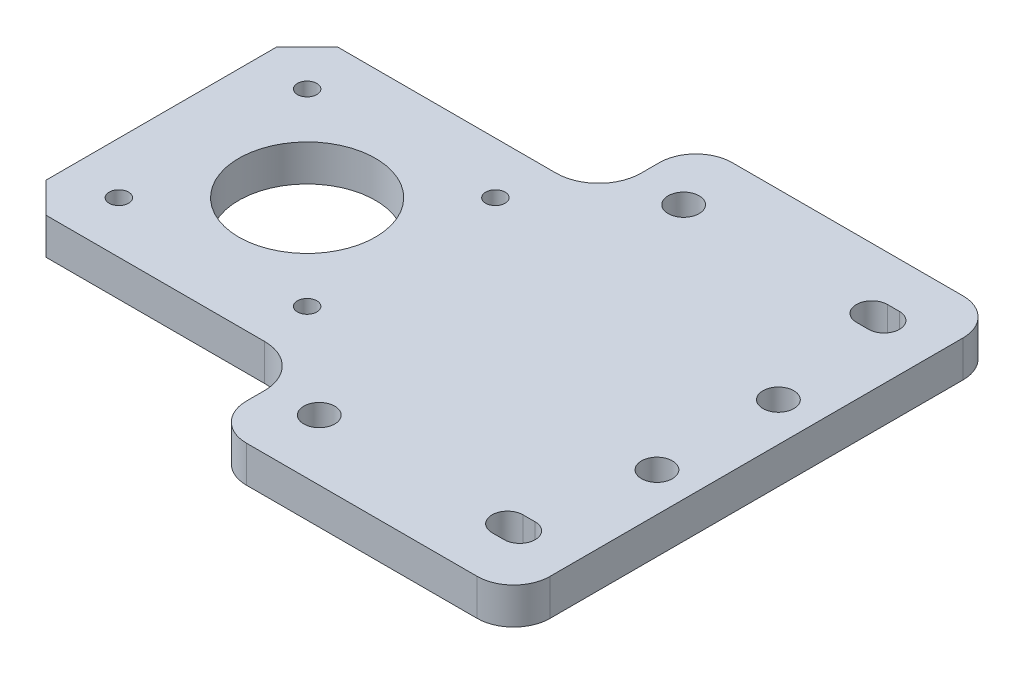
ISO-10303-21;
HEADER;
FILE_DESCRIPTION(('STEP AP214'),'2;1');
FILE_NAME('part.step','',(''),(''),'','','');
FILE_SCHEMA(('AUTOMOTIVE_DESIGN { 1 0 10303 214 1 1 1 1 }'));
ENDSEC;
DATA;
#1=APPLICATION_CONTEXT('core data for automotive mechanical design processes');
#2=APPLICATION_PROTOCOL_DEFINITION('international standard','automotive_design',2000,#1);
#3=PRODUCT_CONTEXT('',#1,'mechanical');
#4=PRODUCT('Part','Part','',(#3));
#5=PRODUCT_RELATED_PRODUCT_CATEGORY('part','',(#4));
#6=PRODUCT_DEFINITION_FORMATION('','',#4);
#7=PRODUCT_DEFINITION_CONTEXT('part definition',#1,'design');
#8=PRODUCT_DEFINITION('design','',#6,#7);
#9=PRODUCT_DEFINITION_SHAPE('','',#8);
#10=(LENGTH_UNIT() NAMED_UNIT(*) SI_UNIT(.MILLI.,.METRE.));
#11=(NAMED_UNIT(*) PLANE_ANGLE_UNIT() SI_UNIT($,.RADIAN.));
#12=(NAMED_UNIT(*) SI_UNIT($,.STERADIAN.) SOLID_ANGLE_UNIT());
#13=UNCERTAINTY_MEASURE_WITH_UNIT(LENGTH_MEASURE(1.E-05),#10,'distance_accuracy_value','');
#14=(GEOMETRIC_REPRESENTATION_CONTEXT(3) GLOBAL_UNCERTAINTY_ASSIGNED_CONTEXT((#13)) GLOBAL_UNIT_ASSIGNED_CONTEXT((#10,
#11,#12)) REPRESENTATION_CONTEXT('',''));
#15=CARTESIAN_POINT('',(0.,0.,0.));
#16=DIRECTION('',(0.,0.,1.));
#17=DIRECTION('',(1.,0.,0.));
#18=AXIS2_PLACEMENT_3D('',#15,#16,#17);
#19=CARTESIAN_POINT('',(19.,6.,-34.));
#20=DIRECTION('',(0.,-1.,0.));
#21=DIRECTION('',(0.,0.,-1.));
#22=AXIS2_PLACEMENT_3D('',#19,#20,#21);
#23=PLANE('',#22);
#24=CARTESIAN_POINT('',(-17.,6.,30.));
#25=DIRECTION('',(0.,-1.,0.));
#26=DIRECTION('',(0.,0.,1.));
#27=AXIS2_PLACEMENT_3D('',#24,#25,#26);
#28=CIRCLE('',#27,2.55);
#29=CARTESIAN_POINT('',(-17.,6.,32.55));
#30=VERTEX_POINT('',#29);
#31=EDGE_CURVE('E250',#30,#30,#28,.T.);
#32=ORIENTED_EDGE('',*,*,#31,.T.);
#33=EDGE_LOOP('',(#32));
#34=FACE_BOUND('',#33,.T.);
#35=DIRECTION('',(1.,0.,0.));
#36=VECTOR('',#35,1.);
#37=CARTESIAN_POINT('',(16.,6.,27.45));
#38=LINE('',#37,#36);
#39=CARTESIAN_POINT('',(14.,6.,27.45));
#40=VERTEX_POINT('',#39);
#41=CARTESIAN_POINT('',(16.,6.,27.45));
#42=VERTEX_POINT('',#41);
#43=EDGE_CURVE('E243',#40,#42,#38,.T.);
#44=ORIENTED_EDGE('',*,*,#43,.T.);
#45=CARTESIAN_POINT('',(16.,6.,30.));
#46=DIRECTION('',(0.,-1.,0.));
#47=DIRECTION('',(0.,0.,1.));
#48=AXIS2_PLACEMENT_3D('',#45,#46,#47);
#49=CIRCLE('',#48,2.55000000000001);
#50=CARTESIAN_POINT('',(16.,6.,32.55));
#51=VERTEX_POINT('',#50);
#52=EDGE_CURVE('E235',#42,#51,#49,.T.);
#53=ORIENTED_EDGE('',*,*,#52,.T.);
#54=DIRECTION('',(-1.,0.,0.));
#55=VECTOR('',#54,1.);
#56=CARTESIAN_POINT('',(16.,6.,32.55));
#57=LINE('',#56,#55);
#58=CARTESIAN_POINT('',(14.,6.,32.55));
#59=VERTEX_POINT('',#58);
#60=EDGE_CURVE('E238',#51,#59,#57,.T.);
#61=ORIENTED_EDGE('',*,*,#60,.T.);
#62=CARTESIAN_POINT('',(14.,6.,30.));
#63=DIRECTION('',(0.,-1.,0.));
#64=DIRECTION('',(0.,0.,1.));
#65=AXIS2_PLACEMENT_3D('',#62,#63,#64);
#66=CIRCLE('',#65,2.55000000000001);
#67=EDGE_CURVE('E48',#59,#40,#66,.T.);
#68=ORIENTED_EDGE('',*,*,#67,.T.);
#69=EDGE_LOOP('',(#44,#53,#61,#68));
#70=FACE_BOUND('',#69,.T.);
#71=DIRECTION('',(1.,0.,0.));
#72=VECTOR('',#71,1.);
#73=CARTESIAN_POINT('',(16.,6.,-32.55));
#74=LINE('',#73,#72);
#75=CARTESIAN_POINT('',(14.,6.,-32.55));
#76=VERTEX_POINT('',#75);
#77=CARTESIAN_POINT('',(16.,6.,-32.55));
#78=VERTEX_POINT('',#77);
#79=EDGE_CURVE('E206',#76,#78,#74,.T.);
#80=ORIENTED_EDGE('',*,*,#79,.T.);
#81=CARTESIAN_POINT('',(16.,6.,-30.));
#82=DIRECTION('',(0.,-1.,0.));
#83=DIRECTION('',(0.,0.,-1.));
#84=AXIS2_PLACEMENT_3D('',#81,#82,#83);
#85=CIRCLE('',#84,2.55000000000001);
#86=CARTESIAN_POINT('',(16.,6.,-27.45));
#87=VERTEX_POINT('',#86);
#88=EDGE_CURVE('E198',#78,#87,#85,.T.);
#89=ORIENTED_EDGE('',*,*,#88,.T.);
#90=DIRECTION('',(-1.,0.,0.));
#91=VECTOR('',#90,1.);
#92=CARTESIAN_POINT('',(16.,6.,-27.45));
#93=LINE('',#92,#91);
#94=CARTESIAN_POINT('',(14.,6.,-27.45));
#95=VERTEX_POINT('',#94);
#96=EDGE_CURVE('E209',#87,#95,#93,.T.);
#97=ORIENTED_EDGE('',*,*,#96,.T.);
#98=CARTESIAN_POINT('',(14.,6.,-30.));
#99=DIRECTION('',(0.,-1.,0.));
#100=DIRECTION('',(0.,0.,-1.));
#101=AXIS2_PLACEMENT_3D('',#98,#99,#100);
#102=CIRCLE('',#101,2.55000000000001);
#103=EDGE_CURVE('E56',#95,#76,#102,.T.);
#104=ORIENTED_EDGE('',*,*,#103,.T.);
#105=EDGE_LOOP('',(#80,#89,#97,#104));
#106=FACE_BOUND('',#105,.T.);
#107=CARTESIAN_POINT('',(-17.,6.,-30.));
#108=DIRECTION('',(0.,-1.,0.));
#109=DIRECTION('',(0.,0.,-1.));
#110=AXIS2_PLACEMENT_3D('',#107,#108,#109);
#111=CIRCLE('',#110,2.55);
#112=CARTESIAN_POINT('',(-17.,6.,-32.55));
#113=VERTEX_POINT('',#112);
#114=EDGE_CURVE('E270',#113,#113,#111,.T.);
#115=ORIENTED_EDGE('',*,*,#114,.T.);
#116=EDGE_LOOP('',(#115));
#117=FACE_BOUND('',#116,.T.);
#118=CARTESIAN_POINT('',(19.,6.,-34.));
#119=DIRECTION('',(0.,1.,0.));
#120=DIRECTION('',(0.,0.,-1.));
#121=AXIS2_PLACEMENT_3D('',#118,#119,#120);
#122=CIRCLE('',#121,6.);
#123=CARTESIAN_POINT('',(25.,6.,-34.));
#124=VERTEX_POINT('',#123);
#125=CARTESIAN_POINT('',(19.,6.,-40.));
#126=VERTEX_POINT('',#125);
#127=EDGE_CURVE('E318',#124,#126,#122,.T.);
#128=ORIENTED_EDGE('',*,*,#127,.T.);
#129=DIRECTION('',(-1.,0.,0.));
#130=VECTOR('',#129,1.);
#131=CARTESIAN_POINT('',(-19.,6.,-40.));
#132=LINE('',#131,#130);
#133=CARTESIAN_POINT('',(-19.,6.,-40.));
#134=VERTEX_POINT('',#133);
#135=EDGE_CURVE('E321',#126,#134,#132,.T.);
#136=ORIENTED_EDGE('',*,*,#135,.T.);
#137=CARTESIAN_POINT('',(-19.,6.,-34.));
#138=DIRECTION('',(0.,1.,0.));
#139=DIRECTION('',(0.,0.,-1.));
#140=AXIS2_PLACEMENT_3D('',#137,#138,#139);
#141=CIRCLE('',#140,6.);
#142=CARTESIAN_POINT('',(-25.,6.,-34.));
#143=VERTEX_POINT('',#142);
#144=EDGE_CURVE('E324',#134,#143,#141,.T.);
#145=ORIENTED_EDGE('',*,*,#144,.T.);
#146=DIRECTION('',(0.,0.,1.));
#147=VECTOR('',#146,1.);
#148=CARTESIAN_POINT('',(-25.,6.,-31.));
#149=LINE('',#148,#147);
#150=CARTESIAN_POINT('',(-25.,6.,-31.));
#151=VERTEX_POINT('',#150);
#152=EDGE_CURVE('E326',#143,#151,#149,.T.);
#153=ORIENTED_EDGE('',*,*,#152,.T.);
#154=CARTESIAN_POINT('',(-32.,6.,-31.));
#155=DIRECTION('',(0.,-1.,0.));
#156=DIRECTION('',(0.,0.,1.));
#157=AXIS2_PLACEMENT_3D('',#154,#155,#156);
#158=CIRCLE('',#157,7.);
#159=CARTESIAN_POINT('',(-32.,6.,-24.));
#160=VERTEX_POINT('',#159);
#161=EDGE_CURVE('E328',#151,#160,#158,.T.);
#162=ORIENTED_EDGE('',*,*,#161,.T.);
#163=DIRECTION('',(-1.,0.,0.));
#164=VECTOR('',#163,1.);
#165=CARTESIAN_POINT('',(-32.,6.,-24.));
#166=LINE('',#165,#164);
#167=CARTESIAN_POINT('',(-68.,6.,-24.));
#168=VERTEX_POINT('',#167);
#169=EDGE_CURVE('E330',#160,#168,#166,.T.);
#170=ORIENTED_EDGE('',*,*,#169,.T.);
#171=DIRECTION('',(-0.707106781186547,0.,0.707106781186548));
#172=VECTOR('',#171,1.);
#173=CARTESIAN_POINT('',(-68.,6.,-24.));
#174=LINE('',#173,#172);
#175=CARTESIAN_POINT('',(-73.,6.,-19.));
#176=VERTEX_POINT('',#175);
#177=EDGE_CURVE('E332',#168,#176,#174,.T.);
#178=ORIENTED_EDGE('',*,*,#177,.T.);
#179=DIRECTION('',(0.,0.,1.));
#180=VECTOR('',#179,1.);
#181=CARTESIAN_POINT('',(-73.,6.,19.));
#182=LINE('',#181,#180);
#183=CARTESIAN_POINT('',(-73.,6.,19.));
#184=VERTEX_POINT('',#183);
#185=EDGE_CURVE('E334',#176,#184,#182,.T.);
#186=ORIENTED_EDGE('',*,*,#185,.T.);
#187=DIRECTION('',(0.707106781186548,0.,0.707106781186547));
#188=VECTOR('',#187,1.);
#189=CARTESIAN_POINT('',(-68.,6.,24.));
#190=LINE('',#189,#188);
#191=CARTESIAN_POINT('',(-68.,6.,24.));
#192=VERTEX_POINT('',#191);
#193=EDGE_CURVE('E336',#184,#192,#190,.T.);
#194=ORIENTED_EDGE('',*,*,#193,.T.);
#195=DIRECTION('',(1.,0.,0.));
#196=VECTOR('',#195,1.);
#197=CARTESIAN_POINT('',(-32.,6.,24.));
#198=LINE('',#197,#196);
#199=CARTESIAN_POINT('',(-32.,6.,24.));
#200=VERTEX_POINT('',#199);
#201=EDGE_CURVE('E338',#192,#200,#198,.T.);
#202=ORIENTED_EDGE('',*,*,#201,.T.);
#203=CARTESIAN_POINT('',(-32.,6.,31.));
#204=DIRECTION('',(0.,-1.,0.));
#205=DIRECTION('',(0.,0.,1.));
#206=AXIS2_PLACEMENT_3D('',#203,#204,#205);
#207=CIRCLE('',#206,7.);
#208=CARTESIAN_POINT('',(-25.,6.,31.));
#209=VERTEX_POINT('',#208);
#210=EDGE_CURVE('E340',#200,#209,#207,.T.);
#211=ORIENTED_EDGE('',*,*,#210,.T.);
#212=DIRECTION('',(0.,0.,1.));
#213=VECTOR('',#212,1.);
#214=CARTESIAN_POINT('',(-25.,6.,34.));
#215=LINE('',#214,#213);
#216=CARTESIAN_POINT('',(-25.,6.,34.));
#217=VERTEX_POINT('',#216);
#218=EDGE_CURVE('E342',#209,#217,#215,.T.);
#219=ORIENTED_EDGE('',*,*,#218,.T.);
#220=CARTESIAN_POINT('',(-19.,6.,34.));
#221=DIRECTION('',(0.,1.,0.));
#222=DIRECTION('',(0.,0.,-1.));
#223=AXIS2_PLACEMENT_3D('',#220,#221,#222);
#224=CIRCLE('',#223,6.);
#225=CARTESIAN_POINT('',(-19.,6.,40.));
#226=VERTEX_POINT('',#225);
#227=EDGE_CURVE('E344',#217,#226,#224,.T.);
#228=ORIENTED_EDGE('',*,*,#227,.T.);
#229=DIRECTION('',(1.,0.,0.));
#230=VECTOR('',#229,1.);
#231=CARTESIAN_POINT('',(-19.,6.,40.));
#232=LINE('',#231,#230);
#233=CARTESIAN_POINT('',(19.,6.,40.));
#234=VERTEX_POINT('',#233);
#235=EDGE_CURVE('E346',#226,#234,#232,.T.);
#236=ORIENTED_EDGE('',*,*,#235,.T.);
#237=CARTESIAN_POINT('',(19.,6.,34.));
#238=DIRECTION('',(0.,1.,0.));
#239=DIRECTION('',(0.,0.,1.));
#240=AXIS2_PLACEMENT_3D('',#237,#238,#239);
#241=CIRCLE('',#240,6.);
#242=CARTESIAN_POINT('',(25.,6.,34.));
#243=VERTEX_POINT('',#242);
#244=EDGE_CURVE('E348',#234,#243,#241,.T.);
#245=ORIENTED_EDGE('',*,*,#244,.T.);
#246=DIRECTION('',(0.,0.,-1.));
#247=VECTOR('',#246,1.);
#248=CARTESIAN_POINT('',(25.,6.,34.));
#249=LINE('',#248,#247);
#250=EDGE_CURVE('E350',#243,#124,#249,.T.);
#251=ORIENTED_EDGE('',*,*,#250,.T.);
#252=EDGE_LOOP('',(#128,#136,#145,#153,#162,#170,#178,#186,#194,#202,#211,#219,#228,#236,#245,#251));
#253=FACE_BOUND('',#252,.T.);
#254=CARTESIAN_POINT('',(-49.,6.,0.));
#255=DIRECTION('',(0.,1.,0.));
#256=DIRECTION('',(0.,0.,1.));
#257=AXIS2_PLACEMENT_3D('',#254,#255,#256);
#258=CIRCLE('',#257,11.25);
#259=CARTESIAN_POINT('',(-49.,6.,11.25));
#260=VERTEX_POINT('',#259);
#261=EDGE_CURVE('E312',#260,#260,#258,.T.);
#262=ORIENTED_EDGE('',*,*,#261,.F.);
#263=EDGE_LOOP('',(#262));
#264=FACE_BOUND('',#263,.T.);
#265=CARTESIAN_POINT('',(-64.5,6.,-15.5));
#266=DIRECTION('',(0.,1.,0.));
#267=DIRECTION('',(0.,0.,1.));
#268=AXIS2_PLACEMENT_3D('',#265,#266,#267);
#269=CIRCLE('',#268,1.6);
#270=CARTESIAN_POINT('',(-64.5,6.,-13.9));
#271=VERTEX_POINT('',#270);
#272=EDGE_CURVE('E306',#271,#271,#269,.T.);
#273=ORIENTED_EDGE('',*,*,#272,.F.);
#274=EDGE_LOOP('',(#273));
#275=FACE_BOUND('',#274,.T.);
#276=CARTESIAN_POINT('',(-64.5,6.,15.5));
#277=DIRECTION('',(0.,1.,0.));
#278=DIRECTION('',(0.,0.,-1.));
#279=AXIS2_PLACEMENT_3D('',#276,#277,#278);
#280=CIRCLE('',#279,1.6);
#281=CARTESIAN_POINT('',(-64.5,6.,13.9));
#282=VERTEX_POINT('',#281);
#283=EDGE_CURVE('E300',#282,#282,#280,.T.);
#284=ORIENTED_EDGE('',*,*,#283,.F.);
#285=EDGE_LOOP('',(#284));
#286=FACE_BOUND('',#285,.T.);
#287=CARTESIAN_POINT('',(-33.5,6.,-15.5));
#288=DIRECTION('',(0.,1.,0.));
#289=DIRECTION('',(0.,0.,-1.));
#290=AXIS2_PLACEMENT_3D('',#287,#288,#289);
#291=CIRCLE('',#290,1.6);
#292=CARTESIAN_POINT('',(-33.5,6.,-17.1));
#293=VERTEX_POINT('',#292);
#294=EDGE_CURVE('E294',#293,#293,#291,.T.);
#295=ORIENTED_EDGE('',*,*,#294,.F.);
#296=EDGE_LOOP('',(#295));
#297=FACE_BOUND('',#296,.T.);
#298=CARTESIAN_POINT('',(-33.5,6.,15.5));
#299=DIRECTION('',(0.,1.,0.));
#300=DIRECTION('',(0.,0.,1.));
#301=AXIS2_PLACEMENT_3D('',#298,#299,#300);
#302=CIRCLE('',#301,1.6);
#303=CARTESIAN_POINT('',(-33.5,6.,17.1));
#304=VERTEX_POINT('',#303);
#305=EDGE_CURVE('E288',#304,#304,#302,.T.);
#306=ORIENTED_EDGE('',*,*,#305,.F.);
#307=EDGE_LOOP('',(#306));
#308=FACE_BOUND('',#307,.T.);
#309=CARTESIAN_POINT('',(18.6049999971627,6.,10.0000000000055));
#310=DIRECTION('',(0.,1.,0.));
#311=DIRECTION('',(0.,0.,1.));
#312=AXIS2_PLACEMENT_3D('',#309,#310,#311);
#313=CIRCLE('',#312,2.55000000220871);
#314=CARTESIAN_POINT('',(18.6049999971627,6.,12.5500000022142));
#315=VERTEX_POINT('',#314);
#316=EDGE_CURVE('E282',#315,#315,#313,.T.);
#317=ORIENTED_EDGE('',*,*,#316,.F.);
#318=EDGE_LOOP('',(#317));
#319=FACE_BOUND('',#318,.T.);
#320=CARTESIAN_POINT('',(18.6049999971627,6.,-10.0000000000055));
#321=DIRECTION('',(0.,1.,0.));
#322=DIRECTION('',(0.,0.,-1.));
#323=AXIS2_PLACEMENT_3D('',#320,#321,#322);
#324=CIRCLE('',#323,2.55000000220865);
#325=CARTESIAN_POINT('',(18.6049999971627,6.,-12.5500000022141));
#326=VERTEX_POINT('',#325);
#327=EDGE_CURVE('E276',#326,#326,#324,.T.);
#328=ORIENTED_EDGE('',*,*,#327,.F.);
#329=EDGE_LOOP('',(#328));
#330=FACE_BOUND('',#329,.T.);
#331=ADVANCED_FACE('F33',(#34,#70,#106,#117,#253,#264,#275,#286,#297,#308,#319,#330),#23,.F.);
#332=CARTESIAN_POINT('',(19.,0.,-34.));
#333=DIRECTION('',(0.,-1.,0.));
#334=DIRECTION('',(0.,0.,-1.));
#335=AXIS2_PLACEMENT_3D('',#332,#333,#334);
#336=PLANE('',#335);
#337=CARTESIAN_POINT('',(-17.,0.,30.));
#338=DIRECTION('',(0.,-1.,0.));
#339=DIRECTION('',(0.,0.,1.));
#340=AXIS2_PLACEMENT_3D('',#337,#338,#339);
#341=CIRCLE('',#340,2.55);
#342=CARTESIAN_POINT('',(-17.,0.,32.55));
#343=VERTEX_POINT('',#342);
#344=EDGE_CURVE('E267',#343,#343,#341,.T.);
#345=ORIENTED_EDGE('',*,*,#344,.F.);
#346=EDGE_LOOP('',(#345));
#347=FACE_BOUND('',#346,.T.);
#348=CARTESIAN_POINT('',(16.,0.,30.));
#349=DIRECTION('',(0.,-1.,0.));
#350=DIRECTION('',(0.,0.,1.));
#351=AXIS2_PLACEMENT_3D('',#348,#349,#350);
#352=CIRCLE('',#351,2.55000000000001);
#353=CARTESIAN_POINT('',(16.,0.,27.45));
#354=VERTEX_POINT('',#353);
#355=CARTESIAN_POINT('',(16.,0.,32.55));
#356=VERTEX_POINT('',#355);
#357=EDGE_CURVE('E247',#354,#356,#352,.T.);
#358=ORIENTED_EDGE('',*,*,#357,.F.);
#359=DIRECTION('',(1.,0.,0.));
#360=VECTOR('',#359,1.);
#361=CARTESIAN_POINT('',(16.,0.,27.45));
#362=LINE('',#361,#360);
#363=CARTESIAN_POINT('',(14.,0.,27.45));
#364=VERTEX_POINT('',#363);
#365=EDGE_CURVE('E239',#364,#354,#362,.T.);
#366=ORIENTED_EDGE('',*,*,#365,.F.);
#367=CARTESIAN_POINT('',(14.,0.,30.));
#368=DIRECTION('',(0.,-1.,0.));
#369=DIRECTION('',(0.,0.,1.));
#370=AXIS2_PLACEMENT_3D('',#367,#368,#369);
#371=CIRCLE('',#370,2.55000000000001);
#372=CARTESIAN_POINT('',(14.,0.,32.55));
#373=VERTEX_POINT('',#372);
#374=EDGE_CURVE('E253',#373,#364,#371,.T.);
#375=ORIENTED_EDGE('',*,*,#374,.F.);
#376=DIRECTION('',(-1.,0.,0.));
#377=VECTOR('',#376,1.);
#378=CARTESIAN_POINT('',(16.,0.,32.55));
#379=LINE('',#378,#377);
#380=EDGE_CURVE('E249',#356,#373,#379,.T.);
#381=ORIENTED_EDGE('',*,*,#380,.F.);
#382=EDGE_LOOP('',(#358,#366,#375,#381));
#383=FACE_BOUND('',#382,.T.);
#384=CARTESIAN_POINT('',(16.,0.,-30.));
#385=DIRECTION('',(0.,-1.,0.));
#386=DIRECTION('',(0.,0.,-1.));
#387=AXIS2_PLACEMENT_3D('',#384,#385,#386);
#388=CIRCLE('',#387,2.55000000000001);
#389=CARTESIAN_POINT('',(16.,0.,-32.55));
#390=VERTEX_POINT('',#389);
#391=CARTESIAN_POINT('',(16.,0.,-27.45));
#392=VERTEX_POINT('',#391);
#393=EDGE_CURVE('E201',#390,#392,#388,.T.);
#394=ORIENTED_EDGE('',*,*,#393,.F.);
#395=DIRECTION('',(1.,0.,0.));
#396=VECTOR('',#395,1.);
#397=CARTESIAN_POINT('',(16.,0.,-32.55));
#398=LINE('',#397,#396);
#399=CARTESIAN_POINT('',(14.,0.,-32.55));
#400=VERTEX_POINT('',#399);
#401=EDGE_CURVE('E215',#400,#390,#398,.T.);
#402=ORIENTED_EDGE('',*,*,#401,.F.);
#403=CARTESIAN_POINT('',(14.,0.,-30.));
#404=DIRECTION('',(0.,-1.,0.));
#405=DIRECTION('',(0.,0.,-1.));
#406=AXIS2_PLACEMENT_3D('',#403,#404,#405);
#407=CIRCLE('',#406,2.55000000000001);
#408=CARTESIAN_POINT('',(14.,0.,-27.45));
#409=VERTEX_POINT('',#408);
#410=EDGE_CURVE('E218',#409,#400,#407,.T.);
#411=ORIENTED_EDGE('',*,*,#410,.F.);
#412=DIRECTION('',(-1.,0.,0.));
#413=VECTOR('',#412,1.);
#414=CARTESIAN_POINT('',(16.,0.,-27.45));
#415=LINE('',#414,#413);
#416=EDGE_CURVE('E224',#392,#409,#415,.T.);
#417=ORIENTED_EDGE('',*,*,#416,.F.);
#418=EDGE_LOOP('',(#394,#402,#411,#417));
#419=FACE_BOUND('',#418,.T.);
#420=CARTESIAN_POINT('',(-17.,0.,-30.));
#421=DIRECTION('',(0.,-1.,0.));
#422=DIRECTION('',(0.,0.,-1.));
#423=AXIS2_PLACEMENT_3D('',#420,#421,#422);
#424=CIRCLE('',#423,2.55);
#425=CARTESIAN_POINT('',(-17.,0.,-32.55));
#426=VERTEX_POINT('',#425);
#427=EDGE_CURVE('E231',#426,#426,#424,.T.);
#428=ORIENTED_EDGE('',*,*,#427,.F.);
#429=EDGE_LOOP('',(#428));
#430=FACE_BOUND('',#429,.T.);
#431=CARTESIAN_POINT('',(18.6049999971627,0.,10.0000000000055));
#432=DIRECTION('',(0.,1.,0.));
#433=DIRECTION('',(0.,0.,1.));
#434=AXIS2_PLACEMENT_3D('',#431,#432,#433);
#435=CIRCLE('',#434,2.55000000220871);
#436=CARTESIAN_POINT('',(18.6049999971627,0.,12.5500000022142));
#437=VERTEX_POINT('',#436);
#438=EDGE_CURVE('E279',#437,#437,#435,.T.);
#439=ORIENTED_EDGE('',*,*,#438,.T.);
#440=EDGE_LOOP('',(#439));
#441=FACE_BOUND('',#440,.T.);
#442=CARTESIAN_POINT('',(-33.5,0.,-15.5));
#443=DIRECTION('',(0.,1.,0.));
#444=DIRECTION('',(0.,0.,-1.));
#445=AXIS2_PLACEMENT_3D('',#442,#443,#444);
#446=CIRCLE('',#445,1.6);
#447=CARTESIAN_POINT('',(-33.5,0.,-17.1));
#448=VERTEX_POINT('',#447);
#449=EDGE_CURVE('E291',#448,#448,#446,.T.);
#450=ORIENTED_EDGE('',*,*,#449,.T.);
#451=EDGE_LOOP('',(#450));
#452=FACE_BOUND('',#451,.T.);
#453=CARTESIAN_POINT('',(-64.5,0.,-15.5));
#454=DIRECTION('',(0.,1.,0.));
#455=DIRECTION('',(0.,0.,1.));
#456=AXIS2_PLACEMENT_3D('',#453,#454,#455);
#457=CIRCLE('',#456,1.6);
#458=CARTESIAN_POINT('',(-64.5,0.,-13.9));
#459=VERTEX_POINT('',#458);
#460=EDGE_CURVE('E303',#459,#459,#457,.T.);
#461=ORIENTED_EDGE('',*,*,#460,.T.);
#462=EDGE_LOOP('',(#461));
#463=FACE_BOUND('',#462,.T.);
#464=CARTESIAN_POINT('',(19.,0.,-34.));
#465=DIRECTION('',(0.,1.,0.));
#466=DIRECTION('',(0.,0.,-1.));
#467=AXIS2_PLACEMENT_3D('',#464,#465,#466);
#468=CIRCLE('',#467,6.);
#469=CARTESIAN_POINT('',(25.,0.,-34.));
#470=VERTEX_POINT('',#469);
#471=CARTESIAN_POINT('',(19.,0.,-40.));
#472=VERTEX_POINT('',#471);
#473=EDGE_CURVE('E315',#470,#472,#468,.T.);
#474=ORIENTED_EDGE('',*,*,#473,.F.);
#475=DIRECTION('',(0.,0.,-1.));
#476=VECTOR('',#475,1.);
#477=CARTESIAN_POINT('',(25.,0.,34.));
#478=LINE('',#477,#476);
#479=CARTESIAN_POINT('',(25.,0.,34.));
#480=VERTEX_POINT('',#479);
#481=EDGE_CURVE('E322',#480,#470,#478,.T.);
#482=ORIENTED_EDGE('',*,*,#481,.F.);
#483=CARTESIAN_POINT('',(19.,0.,34.));
#484=DIRECTION('',(0.,1.,0.));
#485=DIRECTION('',(0.,0.,1.));
#486=AXIS2_PLACEMENT_3D('',#483,#484,#485);
#487=CIRCLE('',#486,6.);
#488=CARTESIAN_POINT('',(19.,0.,40.));
#489=VERTEX_POINT('',#488);
#490=EDGE_CURVE('E381',#489,#480,#487,.T.);
#491=ORIENTED_EDGE('',*,*,#490,.F.);
#492=DIRECTION('',(1.,0.,0.));
#493=VECTOR('',#492,1.);
#494=CARTESIAN_POINT('',(-19.,0.,40.));
#495=LINE('',#494,#493);
#496=CARTESIAN_POINT('',(-19.,0.,40.));
#497=VERTEX_POINT('',#496);
#498=EDGE_CURVE('E379',#497,#489,#495,.T.);
#499=ORIENTED_EDGE('',*,*,#498,.F.);
#500=CARTESIAN_POINT('',(-19.,0.,34.));
#501=DIRECTION('',(0.,1.,0.));
#502=DIRECTION('',(0.,0.,-1.));
#503=AXIS2_PLACEMENT_3D('',#500,#501,#502);
#504=CIRCLE('',#503,6.);
#505=CARTESIAN_POINT('',(-25.,0.,34.));
#506=VERTEX_POINT('',#505);
#507=EDGE_CURVE('E377',#506,#497,#504,.T.);
#508=ORIENTED_EDGE('',*,*,#507,.F.);
#509=DIRECTION('',(0.,0.,1.));
#510=VECTOR('',#509,1.);
#511=CARTESIAN_POINT('',(-25.,0.,34.));
#512=LINE('',#511,#510);
#513=CARTESIAN_POINT('',(-25.,0.,31.));
#514=VERTEX_POINT('',#513);
#515=EDGE_CURVE('E375',#514,#506,#512,.T.);
#516=ORIENTED_EDGE('',*,*,#515,.F.);
#517=CARTESIAN_POINT('',(-32.,0.,31.));
#518=DIRECTION('',(0.,-1.,0.));
#519=DIRECTION('',(0.,0.,1.));
#520=AXIS2_PLACEMENT_3D('',#517,#518,#519);
#521=CIRCLE('',#520,7.);
#522=CARTESIAN_POINT('',(-32.,0.,24.));
#523=VERTEX_POINT('',#522);
#524=EDGE_CURVE('E373',#523,#514,#521,.T.);
#525=ORIENTED_EDGE('',*,*,#524,.F.);
#526=DIRECTION('',(1.,0.,0.));
#527=VECTOR('',#526,1.);
#528=CARTESIAN_POINT('',(-32.,0.,24.));
#529=LINE('',#528,#527);
#530=CARTESIAN_POINT('',(-68.,0.,24.));
#531=VERTEX_POINT('',#530);
#532=EDGE_CURVE('E371',#531,#523,#529,.T.);
#533=ORIENTED_EDGE('',*,*,#532,.F.);
#534=DIRECTION('',(0.707106781186548,0.,0.707106781186547));
#535=VECTOR('',#534,1.);
#536=CARTESIAN_POINT('',(-68.,0.,24.));
#537=LINE('',#536,#535);
#538=CARTESIAN_POINT('',(-73.,0.,19.));
#539=VERTEX_POINT('',#538);
#540=EDGE_CURVE('E369',#539,#531,#537,.T.);
#541=ORIENTED_EDGE('',*,*,#540,.F.);
#542=DIRECTION('',(0.,0.,1.));
#543=VECTOR('',#542,1.);
#544=CARTESIAN_POINT('',(-73.,0.,19.));
#545=LINE('',#544,#543);
#546=CARTESIAN_POINT('',(-73.,0.,-19.));
#547=VERTEX_POINT('',#546);
#548=EDGE_CURVE('E367',#547,#539,#545,.T.);
#549=ORIENTED_EDGE('',*,*,#548,.F.);
#550=DIRECTION('',(-0.707106781186547,0.,0.707106781186548));
#551=VECTOR('',#550,1.);
#552=CARTESIAN_POINT('',(-68.,0.,-24.));
#553=LINE('',#552,#551);
#554=CARTESIAN_POINT('',(-68.,0.,-24.));
#555=VERTEX_POINT('',#554);
#556=EDGE_CURVE('E365',#555,#547,#553,.T.);
#557=ORIENTED_EDGE('',*,*,#556,.F.);
#558=DIRECTION('',(-1.,0.,0.));
#559=VECTOR('',#558,1.);
#560=CARTESIAN_POINT('',(-32.,0.,-24.));
#561=LINE('',#560,#559);
#562=CARTESIAN_POINT('',(-32.,0.,-24.));
#563=VERTEX_POINT('',#562);
#564=EDGE_CURVE('E363',#563,#555,#561,.T.);
#565=ORIENTED_EDGE('',*,*,#564,.F.);
#566=CARTESIAN_POINT('',(-32.,0.,-31.));
#567=DIRECTION('',(0.,-1.,0.));
#568=DIRECTION('',(0.,0.,1.));
#569=AXIS2_PLACEMENT_3D('',#566,#567,#568);
#570=CIRCLE('',#569,7.);
#571=CARTESIAN_POINT('',(-25.,0.,-31.));
#572=VERTEX_POINT('',#571);
#573=EDGE_CURVE('E361',#572,#563,#570,.T.);
#574=ORIENTED_EDGE('',*,*,#573,.F.);
#575=DIRECTION('',(0.,0.,1.));
#576=VECTOR('',#575,1.);
#577=CARTESIAN_POINT('',(-25.,0.,-31.));
#578=LINE('',#577,#576);
#579=CARTESIAN_POINT('',(-25.,0.,-34.));
#580=VERTEX_POINT('',#579);
#581=EDGE_CURVE('E359',#580,#572,#578,.T.);
#582=ORIENTED_EDGE('',*,*,#581,.F.);
#583=CARTESIAN_POINT('',(-19.,0.,-34.));
#584=DIRECTION('',(0.,1.,0.));
#585=DIRECTION('',(0.,0.,-1.));
#586=AXIS2_PLACEMENT_3D('',#583,#584,#585);
#587=CIRCLE('',#586,6.);
#588=CARTESIAN_POINT('',(-19.,0.,-40.));
#589=VERTEX_POINT('',#588);
#590=EDGE_CURVE('E357',#589,#580,#587,.T.);
#591=ORIENTED_EDGE('',*,*,#590,.F.);
#592=DIRECTION('',(-1.,0.,0.));
#593=VECTOR('',#592,1.);
#594=CARTESIAN_POINT('',(-19.,0.,-40.));
#595=LINE('',#594,#593);
#596=EDGE_CURVE('E355',#472,#589,#595,.T.);
#597=ORIENTED_EDGE('',*,*,#596,.F.);
#598=EDGE_LOOP('',(#474,#482,#491,#499,#508,#516,#525,#533,#541,#549,#557,#565,#574,#582,#591,#597));
#599=FACE_BOUND('',#598,.T.);
#600=CARTESIAN_POINT('',(-49.,0.,0.));
#601=DIRECTION('',(0.,1.,0.));
#602=DIRECTION('',(0.,0.,1.));
#603=AXIS2_PLACEMENT_3D('',#600,#601,#602);
#604=CIRCLE('',#603,11.25);
#605=CARTESIAN_POINT('',(-49.,0.,11.25));
#606=VERTEX_POINT('',#605);
#607=EDGE_CURVE('E309',#606,#606,#604,.T.);
#608=ORIENTED_EDGE('',*,*,#607,.T.);
#609=EDGE_LOOP('',(#608));
#610=FACE_BOUND('',#609,.T.);
#611=CARTESIAN_POINT('',(-64.5,0.,15.5));
#612=DIRECTION('',(0.,1.,0.));
#613=DIRECTION('',(0.,0.,-1.));
#614=AXIS2_PLACEMENT_3D('',#611,#612,#613);
#615=CIRCLE('',#614,1.6);
#616=CARTESIAN_POINT('',(-64.5,0.,13.9));
#617=VERTEX_POINT('',#616);
#618=EDGE_CURVE('E297',#617,#617,#615,.T.);
#619=ORIENTED_EDGE('',*,*,#618,.T.);
#620=EDGE_LOOP('',(#619));
#621=FACE_BOUND('',#620,.T.);
#622=CARTESIAN_POINT('',(-33.5,0.,15.5));
#623=DIRECTION('',(0.,1.,0.));
#624=DIRECTION('',(0.,0.,1.));
#625=AXIS2_PLACEMENT_3D('',#622,#623,#624);
#626=CIRCLE('',#625,1.6);
#627=CARTESIAN_POINT('',(-33.5,0.,17.1));
#628=VERTEX_POINT('',#627);
#629=EDGE_CURVE('E285',#628,#628,#626,.T.);
#630=ORIENTED_EDGE('',*,*,#629,.T.);
#631=EDGE_LOOP('',(#630));
#632=FACE_BOUND('',#631,.T.);
#633=CARTESIAN_POINT('',(18.6049999971627,0.,-10.0000000000055));
#634=DIRECTION('',(0.,1.,0.));
#635=DIRECTION('',(0.,0.,-1.));
#636=AXIS2_PLACEMENT_3D('',#633,#634,#635);
#637=CIRCLE('',#636,2.55000000220865);
#638=CARTESIAN_POINT('',(18.6049999971627,0.,-12.5500000022141));
#639=VERTEX_POINT('',#638);
#640=EDGE_CURVE('E273',#639,#639,#637,.T.);
#641=ORIENTED_EDGE('',*,*,#640,.T.);
#642=EDGE_LOOP('',(#641));
#643=FACE_BOUND('',#642,.T.);
#644=ADVANCED_FACE('F435',(#347,#383,#419,#430,#441,#452,#463,#599,#610,#621,#632,#643),#336,.T.);
#645=CARTESIAN_POINT('',(19.,6.,-34.));
#646=DIRECTION('',(0.,-1.,0.));
#647=DIRECTION('',(0.,0.,-1.));
#648=AXIS2_PLACEMENT_3D('',#645,#646,#647);
#649=CYLINDRICAL_SURFACE('',#648,6.);
#650=ORIENTED_EDGE('',*,*,#473,.T.);
#651=DIRECTION('',(0.,-1.,0.));
#652=VECTOR('',#651,1.);
#653=CARTESIAN_POINT('',(19.,6.,-40.));
#654=LINE('',#653,#652);
#655=EDGE_CURVE('E11',#126,#472,#654,.T.);
#656=ORIENTED_EDGE('',*,*,#655,.F.);
#657=ORIENTED_EDGE('',*,*,#127,.F.);
#658=DIRECTION('',(0.,-1.,0.));
#659=VECTOR('',#658,1.);
#660=CARTESIAN_POINT('',(25.,6.,-34.));
#661=LINE('',#660,#659);
#662=EDGE_CURVE('E352',#124,#470,#661,.T.);
#663=ORIENTED_EDGE('',*,*,#662,.T.);
#664=EDGE_LOOP('',(#650,#656,#657,#663));
#665=FACE_BOUND('',#664,.T.);
#666=ADVANCED_FACE('F35',(#665),#649,.T.);
#667=CARTESIAN_POINT('',(-19.,6.,-40.));
#668=DIRECTION('',(0.,0.,1.));
#669=DIRECTION('',(1.,0.,0.));
#670=AXIS2_PLACEMENT_3D('',#667,#668,#669);
#671=PLANE('',#670);
#672=ORIENTED_EDGE('',*,*,#596,.T.);
#673=DIRECTION('',(0.,-1.,0.));
#674=VECTOR('',#673,1.);
#675=CARTESIAN_POINT('',(-19.,6.,-40.));
#676=LINE('',#675,#674);
#677=EDGE_CURVE('E41',#134,#589,#676,.T.);
#678=ORIENTED_EDGE('',*,*,#677,.F.);
#679=ORIENTED_EDGE('',*,*,#135,.F.);
#680=ORIENTED_EDGE('',*,*,#655,.T.);
#681=EDGE_LOOP('',(#672,#678,#679,#680));
#682=FACE_BOUND('',#681,.T.);
#683=ADVANCED_FACE('F453',(#682),#671,.F.);
#684=CARTESIAN_POINT('',(-19.,6.,-34.));
#685=DIRECTION('',(0.,-1.,0.));
#686=DIRECTION('',(0.,0.,-1.));
#687=AXIS2_PLACEMENT_3D('',#684,#685,#686);
#688=CYLINDRICAL_SURFACE('',#687,6.);
#689=ORIENTED_EDGE('',*,*,#590,.T.);
#690=DIRECTION('',(0.,-1.,0.));
#691=VECTOR('',#690,1.);
#692=CARTESIAN_POINT('',(-25.,6.,-34.));
#693=LINE('',#692,#691);
#694=EDGE_CURVE('E422',#143,#580,#693,.T.);
#695=ORIENTED_EDGE('',*,*,#694,.F.);
#696=ORIENTED_EDGE('',*,*,#144,.F.);
#697=ORIENTED_EDGE('',*,*,#677,.T.);
#698=EDGE_LOOP('',(#689,#695,#696,#697));
#699=FACE_BOUND('',#698,.T.);
#700=ADVANCED_FACE('F429',(#699),#688,.T.);
#701=CARTESIAN_POINT('',(-25.,6.,-31.));
#702=DIRECTION('',(1.,0.,0.));
#703=DIRECTION('',(0.,0.,-1.));
#704=AXIS2_PLACEMENT_3D('',#701,#702,#703);
#705=PLANE('',#704);
#706=ORIENTED_EDGE('',*,*,#581,.T.);
#707=DIRECTION('',(0.,-1.,0.));
#708=VECTOR('',#707,1.);
#709=CARTESIAN_POINT('',(-25.,6.,-31.));
#710=LINE('',#709,#708);
#711=EDGE_CURVE('E419',#151,#572,#710,.T.);
#712=ORIENTED_EDGE('',*,*,#711,.F.);
#713=ORIENTED_EDGE('',*,*,#152,.F.);
#714=ORIENTED_EDGE('',*,*,#694,.T.);
#715=EDGE_LOOP('',(#706,#712,#713,#714));
#716=FACE_BOUND('',#715,.T.);
#717=ADVANCED_FACE('F441',(#716),#705,.F.);
#718=CARTESIAN_POINT('',(-32.,6.,-31.));
#719=DIRECTION('',(0.,-1.,0.));
#720=DIRECTION('',(0.,0.,-1.));
#721=AXIS2_PLACEMENT_3D('',#718,#719,#720);
#722=CYLINDRICAL_SURFACE('',#721,7.);
#723=ORIENTED_EDGE('',*,*,#573,.T.);
#724=DIRECTION('',(0.,-1.,0.));
#725=VECTOR('',#724,1.);
#726=CARTESIAN_POINT('',(-32.,6.,-24.));
#727=LINE('',#726,#725);
#728=EDGE_CURVE('E416',#160,#563,#727,.T.);
#729=ORIENTED_EDGE('',*,*,#728,.F.);
#730=ORIENTED_EDGE('',*,*,#161,.F.);
#731=ORIENTED_EDGE('',*,*,#711,.T.);
#732=EDGE_LOOP('',(#723,#729,#730,#731));
#733=FACE_BOUND('',#732,.T.);
#734=ADVANCED_FACE('F445',(#733),#722,.F.);
#735=CARTESIAN_POINT('',(-32.,6.,-24.));
#736=DIRECTION('',(0.,0.,1.));
#737=DIRECTION('',(1.,0.,0.));
#738=AXIS2_PLACEMENT_3D('',#735,#736,#737);
#739=PLANE('',#738);
#740=ORIENTED_EDGE('',*,*,#564,.T.);
#741=DIRECTION('',(0.,-1.,0.));
#742=VECTOR('',#741,1.);
#743=CARTESIAN_POINT('',(-68.,6.,-24.));
#744=LINE('',#743,#742);
#745=EDGE_CURVE('E413',#168,#555,#744,.T.);
#746=ORIENTED_EDGE('',*,*,#745,.F.);
#747=ORIENTED_EDGE('',*,*,#169,.F.);
#748=ORIENTED_EDGE('',*,*,#728,.T.);
#749=EDGE_LOOP('',(#740,#746,#747,#748));
#750=FACE_BOUND('',#749,.T.);
#751=ADVANCED_FACE('F506',(#750),#739,.F.);
#752=CARTESIAN_POINT('',(-68.,6.,-24.));
#753=DIRECTION('',(0.707106781186548,0.,0.707106781186547));
#754=DIRECTION('',(0.707106781186547,0.,-0.707106781186548));
#755=AXIS2_PLACEMENT_3D('',#752,#753,#754);
#756=PLANE('',#755);
#757=ORIENTED_EDGE('',*,*,#556,.T.);
#758=DIRECTION('',(0.,-1.,0.));
#759=VECTOR('',#758,1.);
#760=CARTESIAN_POINT('',(-73.,6.,-19.));
#761=LINE('',#760,#759);
#762=EDGE_CURVE('E410',#176,#547,#761,.T.);
#763=ORIENTED_EDGE('',*,*,#762,.F.);
#764=ORIENTED_EDGE('',*,*,#177,.F.);
#765=ORIENTED_EDGE('',*,*,#745,.T.);
#766=EDGE_LOOP('',(#757,#763,#764,#765));
#767=FACE_BOUND('',#766,.T.);
#768=ADVANCED_FACE('F503',(#767),#756,.F.);
#769=CARTESIAN_POINT('',(-73.,6.,19.));
#770=DIRECTION('',(1.,0.,0.));
#771=DIRECTION('',(0.,0.,-1.));
#772=AXIS2_PLACEMENT_3D('',#769,#770,#771);
#773=PLANE('',#772);
#774=ORIENTED_EDGE('',*,*,#548,.T.);
#775=DIRECTION('',(0.,-1.,0.));
#776=VECTOR('',#775,1.);
#777=CARTESIAN_POINT('',(-73.,6.,19.));
#778=LINE('',#777,#776);
#779=EDGE_CURVE('E407',#184,#539,#778,.T.);
#780=ORIENTED_EDGE('',*,*,#779,.F.);
#781=ORIENTED_EDGE('',*,*,#185,.F.);
#782=ORIENTED_EDGE('',*,*,#762,.T.);
#783=EDGE_LOOP('',(#774,#780,#781,#782));
#784=FACE_BOUND('',#783,.T.);
#785=ADVANCED_FACE('F499',(#784),#773,.F.);
#786=CARTESIAN_POINT('',(-68.,6.,24.));
#787=DIRECTION('',(0.707106781186547,0.,-0.707106781186548));
#788=DIRECTION('',(-0.707106781186548,0.,-0.707106781186547));
#789=AXIS2_PLACEMENT_3D('',#786,#787,#788);
#790=PLANE('',#789);
#791=ORIENTED_EDGE('',*,*,#540,.T.);
#792=DIRECTION('',(0.,-1.,0.));
#793=VECTOR('',#792,1.);
#794=CARTESIAN_POINT('',(-68.,6.,24.));
#795=LINE('',#794,#793);
#796=EDGE_CURVE('E404',#192,#531,#795,.T.);
#797=ORIENTED_EDGE('',*,*,#796,.F.);
#798=ORIENTED_EDGE('',*,*,#193,.F.);
#799=ORIENTED_EDGE('',*,*,#779,.T.);
#800=EDGE_LOOP('',(#791,#797,#798,#799));
#801=FACE_BOUND('',#800,.T.);
#802=ADVANCED_FACE('F495',(#801),#790,.F.);
#803=CARTESIAN_POINT('',(-32.,6.,24.));
#804=DIRECTION('',(0.,0.,-1.));
#805=DIRECTION('',(-1.,0.,0.));
#806=AXIS2_PLACEMENT_3D('',#803,#804,#805);
#807=PLANE('',#806);
#808=ORIENTED_EDGE('',*,*,#532,.T.);
#809=DIRECTION('',(0.,-1.,0.));
#810=VECTOR('',#809,1.);
#811=CARTESIAN_POINT('',(-32.,6.,24.));
#812=LINE('',#811,#810);
#813=EDGE_CURVE('E401',#200,#523,#812,.T.);
#814=ORIENTED_EDGE('',*,*,#813,.F.);
#815=ORIENTED_EDGE('',*,*,#201,.F.);
#816=ORIENTED_EDGE('',*,*,#796,.T.);
#817=EDGE_LOOP('',(#808,#814,#815,#816));
#818=FACE_BOUND('',#817,.T.);
#819=ADVANCED_FACE('F490',(#818),#807,.F.);
#820=CARTESIAN_POINT('',(-32.,6.,31.));
#821=DIRECTION('',(0.,-1.,0.));
#822=DIRECTION('',(0.,0.,-1.));
#823=AXIS2_PLACEMENT_3D('',#820,#821,#822);
#824=CYLINDRICAL_SURFACE('',#823,7.);
#825=ORIENTED_EDGE('',*,*,#524,.T.);
#826=DIRECTION('',(0.,-1.,0.));
#827=VECTOR('',#826,1.);
#828=CARTESIAN_POINT('',(-25.,6.,31.));
#829=LINE('',#828,#827);
#830=EDGE_CURVE('E398',#209,#514,#829,.T.);
#831=ORIENTED_EDGE('',*,*,#830,.F.);
#832=ORIENTED_EDGE('',*,*,#210,.F.);
#833=ORIENTED_EDGE('',*,*,#813,.T.);
#834=EDGE_LOOP('',(#825,#831,#832,#833));
#835=FACE_BOUND('',#834,.T.);
#836=ADVANCED_FACE('F484',(#835),#824,.F.);
#837=CARTESIAN_POINT('',(-25.,6.,34.));
#838=DIRECTION('',(1.,0.,0.));
#839=DIRECTION('',(0.,0.,-1.));
#840=AXIS2_PLACEMENT_3D('',#837,#838,#839);
#841=PLANE('',#840);
#842=ORIENTED_EDGE('',*,*,#515,.T.);
#843=DIRECTION('',(0.,-1.,0.));
#844=VECTOR('',#843,1.);
#845=CARTESIAN_POINT('',(-25.,6.,34.));
#846=LINE('',#845,#844);
#847=EDGE_CURVE('E395',#217,#506,#846,.T.);
#848=ORIENTED_EDGE('',*,*,#847,.F.);
#849=ORIENTED_EDGE('',*,*,#218,.F.);
#850=ORIENTED_EDGE('',*,*,#830,.T.);
#851=EDGE_LOOP('',(#842,#848,#849,#850));
#852=FACE_BOUND('',#851,.T.);
#853=ADVANCED_FACE('F480',(#852),#841,.F.);
#854=CARTESIAN_POINT('',(-19.,6.,34.));
#855=DIRECTION('',(0.,-1.,0.));
#856=DIRECTION('',(0.,0.,-1.));
#857=AXIS2_PLACEMENT_3D('',#854,#855,#856);
#858=CYLINDRICAL_SURFACE('',#857,6.);
#859=ORIENTED_EDGE('',*,*,#507,.T.);
#860=DIRECTION('',(0.,-1.,0.));
#861=VECTOR('',#860,1.);
#862=CARTESIAN_POINT('',(-19.,6.,40.));
#863=LINE('',#862,#861);
#864=EDGE_CURVE('E392',#226,#497,#863,.T.);
#865=ORIENTED_EDGE('',*,*,#864,.F.);
#866=ORIENTED_EDGE('',*,*,#227,.F.);
#867=ORIENTED_EDGE('',*,*,#847,.T.);
#868=EDGE_LOOP('',(#859,#865,#866,#867));
#869=FACE_BOUND('',#868,.T.);
#870=ADVANCED_FACE('F475',(#869),#858,.T.);
#871=CARTESIAN_POINT('',(-19.,6.,40.));
#872=DIRECTION('',(0.,0.,-1.));
#873=DIRECTION('',(-1.,0.,0.));
#874=AXIS2_PLACEMENT_3D('',#871,#872,#873);
#875=PLANE('',#874);
#876=ORIENTED_EDGE('',*,*,#498,.T.);
#877=DIRECTION('',(0.,-1.,0.));
#878=VECTOR('',#877,1.);
#879=CARTESIAN_POINT('',(19.,6.,40.));
#880=LINE('',#879,#878);
#881=EDGE_CURVE('E389',#234,#489,#880,.T.);
#882=ORIENTED_EDGE('',*,*,#881,.F.);
#883=ORIENTED_EDGE('',*,*,#235,.F.);
#884=ORIENTED_EDGE('',*,*,#864,.T.);
#885=EDGE_LOOP('',(#876,#882,#883,#884));
#886=FACE_BOUND('',#885,.T.);
#887=ADVANCED_FACE('F469',(#886),#875,.F.);
#888=CARTESIAN_POINT('',(19.,6.,34.));
#889=DIRECTION('',(0.,-1.,0.));
#890=DIRECTION('',(0.,0.,-1.));
#891=AXIS2_PLACEMENT_3D('',#888,#889,#890);
#892=CYLINDRICAL_SURFACE('',#891,6.);
#893=ORIENTED_EDGE('',*,*,#490,.T.);
#894=DIRECTION('',(0.,-1.,0.));
#895=VECTOR('',#894,1.);
#896=CARTESIAN_POINT('',(25.,6.,34.));
#897=LINE('',#896,#895);
#898=EDGE_CURVE('E386',#243,#480,#897,.T.);
#899=ORIENTED_EDGE('',*,*,#898,.F.);
#900=ORIENTED_EDGE('',*,*,#244,.F.);
#901=ORIENTED_EDGE('',*,*,#881,.T.);
#902=EDGE_LOOP('',(#893,#899,#900,#901));
#903=FACE_BOUND('',#902,.T.);
#904=ADVANCED_FACE('F465',(#903),#892,.T.);
#905=CARTESIAN_POINT('',(25.,6.,34.));
#906=DIRECTION('',(-1.,0.,0.));
#907=DIRECTION('',(0.,0.,1.));
#908=AXIS2_PLACEMENT_3D('',#905,#906,#907);
#909=PLANE('',#908);
#910=ORIENTED_EDGE('',*,*,#481,.T.);
#911=ORIENTED_EDGE('',*,*,#662,.F.);
#912=ORIENTED_EDGE('',*,*,#250,.F.);
#913=ORIENTED_EDGE('',*,*,#898,.T.);
#914=EDGE_LOOP('',(#910,#911,#912,#913));
#915=FACE_BOUND('',#914,.T.);
#916=ADVANCED_FACE('F460',(#915),#909,.F.);
#917=CARTESIAN_POINT('',(-49.,6.,0.));
#918=DIRECTION('',(0.,-1.,0.));
#919=DIRECTION('',(0.,0.,-1.));
#920=AXIS2_PLACEMENT_3D('',#917,#918,#919);
#921=CYLINDRICAL_SURFACE('',#920,11.25);
#922=ORIENTED_EDGE('',*,*,#261,.T.);
#923=EDGE_LOOP('',(#922));
#924=FACE_BOUND('',#923,.T.);
#925=ORIENTED_EDGE('',*,*,#607,.F.);
#926=EDGE_LOOP('',(#925));
#927=FACE_BOUND('',#926,.T.);
#928=ADVANCED_FACE('F525',(#924,#927),#921,.F.);
#929=CARTESIAN_POINT('',(-64.5,6.,-15.5));
#930=DIRECTION('',(0.,-1.,0.));
#931=DIRECTION('',(0.,0.,-1.));
#932=AXIS2_PLACEMENT_3D('',#929,#930,#931);
#933=CYLINDRICAL_SURFACE('',#932,1.6);
#934=ORIENTED_EDGE('',*,*,#272,.T.);
#935=EDGE_LOOP('',(#934));
#936=FACE_BOUND('',#935,.T.);
#937=ORIENTED_EDGE('',*,*,#460,.F.);
#938=EDGE_LOOP('',(#937));
#939=FACE_BOUND('',#938,.T.);
#940=ADVANCED_FACE('F587',(#936,#939),#933,.F.);
#941=CARTESIAN_POINT('',(-64.5,6.,15.5));
#942=DIRECTION('',(0.,-1.,0.));
#943=DIRECTION('',(0.,0.,-1.));
#944=AXIS2_PLACEMENT_3D('',#941,#942,#943);
#945=CYLINDRICAL_SURFACE('',#944,1.6);
#946=ORIENTED_EDGE('',*,*,#283,.T.);
#947=EDGE_LOOP('',(#946));
#948=FACE_BOUND('',#947,.T.);
#949=ORIENTED_EDGE('',*,*,#618,.F.);
#950=EDGE_LOOP('',(#949));
#951=FACE_BOUND('',#950,.T.);
#952=ADVANCED_FACE('F594',(#948,#951),#945,.F.);
#953=CARTESIAN_POINT('',(-33.5,6.,-15.5));
#954=DIRECTION('',(0.,-1.,0.));
#955=DIRECTION('',(0.,0.,-1.));
#956=AXIS2_PLACEMENT_3D('',#953,#954,#955);
#957=CYLINDRICAL_SURFACE('',#956,1.6);
#958=ORIENTED_EDGE('',*,*,#294,.T.);
#959=EDGE_LOOP('',(#958));
#960=FACE_BOUND('',#959,.T.);
#961=ORIENTED_EDGE('',*,*,#449,.F.);
#962=EDGE_LOOP('',(#961));
#963=FACE_BOUND('',#962,.T.);
#964=ADVANCED_FACE('F601',(#960,#963),#957,.F.);
#965=CARTESIAN_POINT('',(-33.5,6.,15.5));
#966=DIRECTION('',(0.,-1.,0.));
#967=DIRECTION('',(0.,0.,-1.));
#968=AXIS2_PLACEMENT_3D('',#965,#966,#967);
#969=CYLINDRICAL_SURFACE('',#968,1.6);
#970=ORIENTED_EDGE('',*,*,#305,.T.);
#971=EDGE_LOOP('',(#970));
#972=FACE_BOUND('',#971,.T.);
#973=ORIENTED_EDGE('',*,*,#629,.F.);
#974=EDGE_LOOP('',(#973));
#975=FACE_BOUND('',#974,.T.);
#976=ADVANCED_FACE('F609',(#972,#975),#969,.F.);
#977=CARTESIAN_POINT('',(18.6049999971627,6.,10.0000000000055));
#978=DIRECTION('',(0.,-1.,0.));
#979=DIRECTION('',(0.,0.,-1.));
#980=AXIS2_PLACEMENT_3D('',#977,#978,#979);
#981=CYLINDRICAL_SURFACE('',#980,2.55000000220871);
#982=ORIENTED_EDGE('',*,*,#316,.T.);
#983=EDGE_LOOP('',(#982));
#984=FACE_BOUND('',#983,.T.);
#985=ORIENTED_EDGE('',*,*,#438,.F.);
#986=EDGE_LOOP('',(#985));
#987=FACE_BOUND('',#986,.T.);
#988=ADVANCED_FACE('F617',(#984,#987),#981,.F.);
#989=CARTESIAN_POINT('',(18.6049999971627,6.,-10.0000000000055));
#990=DIRECTION('',(0.,-1.,0.));
#991=DIRECTION('',(0.,0.,-1.));
#992=AXIS2_PLACEMENT_3D('',#989,#990,#991);
#993=CYLINDRICAL_SURFACE('',#992,2.55000000220865);
#994=ORIENTED_EDGE('',*,*,#327,.T.);
#995=EDGE_LOOP('',(#994));
#996=FACE_BOUND('',#995,.T.);
#997=ORIENTED_EDGE('',*,*,#640,.F.);
#998=EDGE_LOOP('',(#997));
#999=FACE_BOUND('',#998,.T.);
#1000=ADVANCED_FACE('F625',(#996,#999),#993,.F.);
#1001=CARTESIAN_POINT('',(-17.,6.,-30.));
#1002=DIRECTION('',(0.,-1.,0.));
#1003=DIRECTION('',(0.,0.,-1.));
#1004=AXIS2_PLACEMENT_3D('',#1001,#1002,#1003);
#1005=CYLINDRICAL_SURFACE('',#1004,2.55);
#1006=ORIENTED_EDGE('',*,*,#114,.F.);
#1007=EDGE_LOOP('',(#1006));
#1008=FACE_BOUND('',#1007,.T.);
#1009=ORIENTED_EDGE('',*,*,#427,.T.);
#1010=EDGE_LOOP('',(#1009));
#1011=FACE_BOUND('',#1010,.T.);
#1012=ADVANCED_FACE('F633',(#1008,#1011),#1005,.F.);
#1013=CARTESIAN_POINT('',(16.,6.,-30.));
#1014=DIRECTION('',(0.,-1.,0.));
#1015=DIRECTION('',(0.,0.,-1.));
#1016=AXIS2_PLACEMENT_3D('',#1013,#1014,#1015);
#1017=CYLINDRICAL_SURFACE('',#1016,2.55000000000001);
#1018=ORIENTED_EDGE('',*,*,#393,.T.);
#1019=DIRECTION('',(0.,-1.,0.));
#1020=VECTOR('',#1019,1.);
#1021=CARTESIAN_POINT('',(16.,6.,-27.45));
#1022=LINE('',#1021,#1020);
#1023=EDGE_CURVE('E194',#87,#392,#1022,.T.);
#1024=ORIENTED_EDGE('',*,*,#1023,.F.);
#1025=ORIENTED_EDGE('',*,*,#88,.F.);
#1026=DIRECTION('',(0.,-1.,0.));
#1027=VECTOR('',#1026,1.);
#1028=CARTESIAN_POINT('',(16.,6.,-32.55));
#1029=LINE('',#1028,#1027);
#1030=EDGE_CURVE('E229',#78,#390,#1029,.T.);
#1031=ORIENTED_EDGE('',*,*,#1030,.T.);
#1032=EDGE_LOOP('',(#1018,#1024,#1025,#1031));
#1033=FACE_BOUND('',#1032,.T.);
#1034=ADVANCED_FACE('F196',(#1033),#1017,.F.);
#1035=CARTESIAN_POINT('',(16.,6.,-32.55));
#1036=DIRECTION('',(0.,0.,-1.));
#1037=DIRECTION('',(-1.,0.,0.));
#1038=AXIS2_PLACEMENT_3D('',#1035,#1036,#1037);
#1039=PLANE('',#1038);
#1040=ORIENTED_EDGE('',*,*,#401,.T.);
#1041=ORIENTED_EDGE('',*,*,#1030,.F.);
#1042=ORIENTED_EDGE('',*,*,#79,.F.);
#1043=DIRECTION('',(0.,-1.,0.));
#1044=VECTOR('',#1043,1.);
#1045=CARTESIAN_POINT('',(14.,6.,-32.55));
#1046=LINE('',#1045,#1044);
#1047=EDGE_CURVE('E232',#76,#400,#1046,.T.);
#1048=ORIENTED_EDGE('',*,*,#1047,.T.);
#1049=EDGE_LOOP('',(#1040,#1041,#1042,#1048));
#1050=FACE_BOUND('',#1049,.T.);
#1051=ADVANCED_FACE('F649',(#1050),#1039,.F.);
#1052=CARTESIAN_POINT('',(14.,6.,-30.));
#1053=DIRECTION('',(0.,-1.,0.));
#1054=DIRECTION('',(0.,0.,-1.));
#1055=AXIS2_PLACEMENT_3D('',#1052,#1053,#1054);
#1056=CYLINDRICAL_SURFACE('',#1055,2.55000000000001);
#1057=ORIENTED_EDGE('',*,*,#410,.T.);
#1058=ORIENTED_EDGE('',*,*,#1047,.F.);
#1059=ORIENTED_EDGE('',*,*,#103,.F.);
#1060=DIRECTION('',(0.,-1.,0.));
#1061=VECTOR('',#1060,1.);
#1062=CARTESIAN_POINT('',(14.,6.,-27.45));
#1063=LINE('',#1062,#1061);
#1064=EDGE_CURVE('E205',#95,#409,#1063,.T.);
#1065=ORIENTED_EDGE('',*,*,#1064,.T.);
#1066=EDGE_LOOP('',(#1057,#1058,#1059,#1065));
#1067=FACE_BOUND('',#1066,.T.);
#1068=ADVANCED_FACE('F656',(#1067),#1056,.F.);
#1069=CARTESIAN_POINT('',(16.,6.,-27.45));
#1070=DIRECTION('',(0.,0.,1.));
#1071=DIRECTION('',(1.,0.,0.));
#1072=AXIS2_PLACEMENT_3D('',#1069,#1070,#1071);
#1073=PLANE('',#1072);
#1074=ORIENTED_EDGE('',*,*,#416,.T.);
#1075=ORIENTED_EDGE('',*,*,#1064,.F.);
#1076=ORIENTED_EDGE('',*,*,#96,.F.);
#1077=ORIENTED_EDGE('',*,*,#1023,.T.);
#1078=EDGE_LOOP('',(#1074,#1075,#1076,#1077));
#1079=FACE_BOUND('',#1078,.T.);
#1080=ADVANCED_FACE('F210',(#1079),#1073,.F.);
#1081=CARTESIAN_POINT('',(16.,6.,30.));
#1082=DIRECTION('',(0.,-1.,0.));
#1083=DIRECTION('',(0.,0.,-1.));
#1084=AXIS2_PLACEMENT_3D('',#1081,#1082,#1083);
#1085=CYLINDRICAL_SURFACE('',#1084,2.55000000000001);
#1086=ORIENTED_EDGE('',*,*,#357,.T.);
#1087=DIRECTION('',(0.,-1.,0.));
#1088=VECTOR('',#1087,1.);
#1089=CARTESIAN_POINT('',(16.,6.,32.55));
#1090=LINE('',#1089,#1088);
#1091=EDGE_CURVE('E246',#51,#356,#1090,.T.);
#1092=ORIENTED_EDGE('',*,*,#1091,.F.);
#1093=ORIENTED_EDGE('',*,*,#52,.F.);
#1094=DIRECTION('',(0.,-1.,0.));
#1095=VECTOR('',#1094,1.);
#1096=CARTESIAN_POINT('',(16.,6.,27.45));
#1097=LINE('',#1096,#1095);
#1098=EDGE_CURVE('E225',#42,#354,#1097,.T.);
#1099=ORIENTED_EDGE('',*,*,#1098,.T.);
#1100=EDGE_LOOP('',(#1086,#1092,#1093,#1099));
#1101=FACE_BOUND('',#1100,.T.);
#1102=ADVANCED_FACE('F670',(#1101),#1085,.F.);
#1103=CARTESIAN_POINT('',(16.,6.,27.45));
#1104=DIRECTION('',(0.,0.,-1.));
#1105=DIRECTION('',(-1.,0.,0.));
#1106=AXIS2_PLACEMENT_3D('',#1103,#1104,#1105);
#1107=PLANE('',#1106);
#1108=ORIENTED_EDGE('',*,*,#365,.T.);
#1109=ORIENTED_EDGE('',*,*,#1098,.F.);
#1110=ORIENTED_EDGE('',*,*,#43,.F.);
#1111=DIRECTION('',(0.,-1.,0.));
#1112=VECTOR('',#1111,1.);
#1113=CARTESIAN_POINT('',(14.,6.,27.45));
#1114=LINE('',#1113,#1112);
#1115=EDGE_CURVE('E259',#40,#364,#1114,.T.);
#1116=ORIENTED_EDGE('',*,*,#1115,.T.);
#1117=EDGE_LOOP('',(#1108,#1109,#1110,#1116));
#1118=FACE_BOUND('',#1117,.T.);
#1119=ADVANCED_FACE('F677',(#1118),#1107,.F.);
#1120=CARTESIAN_POINT('',(14.,6.,30.));
#1121=DIRECTION('',(0.,-1.,0.));
#1122=DIRECTION('',(0.,0.,-1.));
#1123=AXIS2_PLACEMENT_3D('',#1120,#1121,#1122);
#1124=CYLINDRICAL_SURFACE('',#1123,2.55000000000001);
#1125=ORIENTED_EDGE('',*,*,#374,.T.);
#1126=ORIENTED_EDGE('',*,*,#1115,.F.);
#1127=ORIENTED_EDGE('',*,*,#67,.F.);
#1128=DIRECTION('',(0.,-1.,0.));
#1129=VECTOR('',#1128,1.);
#1130=CARTESIAN_POINT('',(14.,6.,32.55));
#1131=LINE('',#1130,#1129);
#1132=EDGE_CURVE('E261',#59,#373,#1131,.T.);
#1133=ORIENTED_EDGE('',*,*,#1132,.T.);
#1134=EDGE_LOOP('',(#1125,#1126,#1127,#1133));
#1135=FACE_BOUND('',#1134,.T.);
#1136=ADVANCED_FACE('F685',(#1135),#1124,.F.);
#1137=CARTESIAN_POINT('',(16.,6.,32.55));
#1138=DIRECTION('',(0.,0.,1.));
#1139=DIRECTION('',(1.,0.,0.));
#1140=AXIS2_PLACEMENT_3D('',#1137,#1138,#1139);
#1141=PLANE('',#1140);
#1142=ORIENTED_EDGE('',*,*,#380,.T.);
#1143=ORIENTED_EDGE('',*,*,#1132,.F.);
#1144=ORIENTED_EDGE('',*,*,#60,.F.);
#1145=ORIENTED_EDGE('',*,*,#1091,.T.);
#1146=EDGE_LOOP('',(#1142,#1143,#1144,#1145));
#1147=FACE_BOUND('',#1146,.T.);
#1148=ADVANCED_FACE('F693',(#1147),#1141,.F.);
#1149=CARTESIAN_POINT('',(-17.,6.,30.));
#1150=DIRECTION('',(0.,-1.,0.));
#1151=DIRECTION('',(0.,0.,-1.));
#1152=AXIS2_PLACEMENT_3D('',#1149,#1150,#1151);
#1153=CYLINDRICAL_SURFACE('',#1152,2.55);
#1154=ORIENTED_EDGE('',*,*,#31,.F.);
#1155=EDGE_LOOP('',(#1154));
#1156=FACE_BOUND('',#1155,.T.);
#1157=ORIENTED_EDGE('',*,*,#344,.T.);
#1158=EDGE_LOOP('',(#1157));
#1159=FACE_BOUND('',#1158,.T.);
#1160=ADVANCED_FACE('F700',(#1156,#1159),#1153,.F.);
#1161=CLOSED_SHELL('',(#331,#644,#666,#683,#700,#717,#734,#751,#768,#785,#802,#819,#836,#853,
#870,#887,#904,#916,#928,#940,#952,#964,#976,#988,#1000,#1012,#1034,#1051,#1068,#1080,#1102,
#1119,#1136,#1148,#1160));
#1162=MANIFOLD_SOLID_BREP('B2',#1161);
#1163=ADVANCED_BREP_SHAPE_REPRESENTATION('',(#18,#1162),#14);
#1164=SHAPE_DEFINITION_REPRESENTATION(#9,#1163);
ENDSEC;
END-ISO-10303-21;
